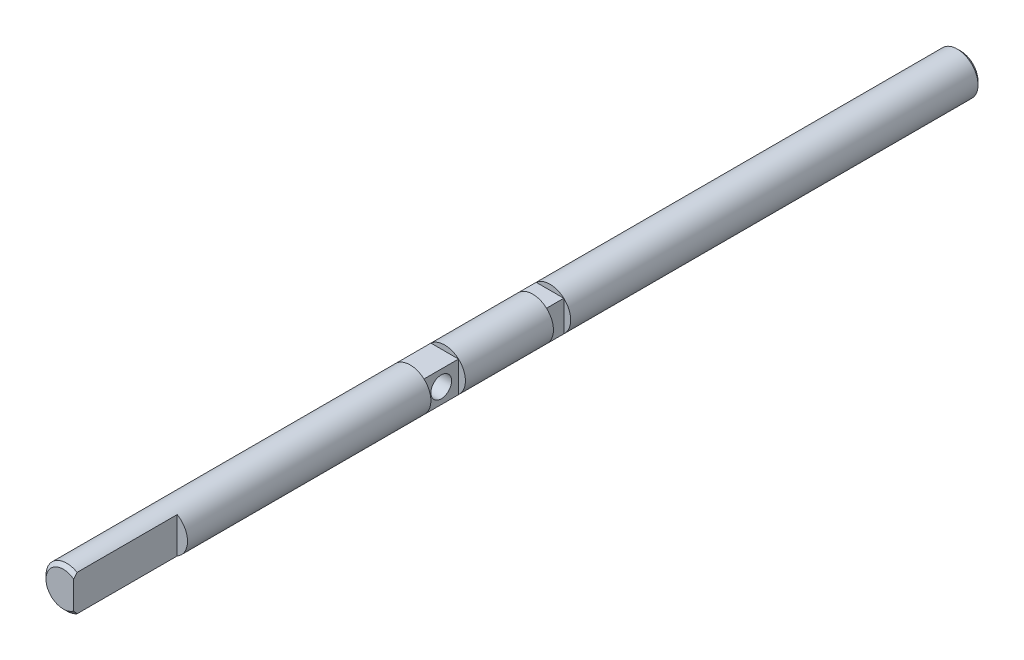
ISO-10303-21;
HEADER;
FILE_DESCRIPTION(('STEP AP214'),'2;1');
FILE_NAME('part.step','',(''),(''),'','','');
FILE_SCHEMA(('AUTOMOTIVE_DESIGN { 1 0 10303 214 1 1 1 1 }'));
ENDSEC;
DATA;
#1=APPLICATION_CONTEXT('core data for automotive mechanical design processes');
#2=APPLICATION_PROTOCOL_DEFINITION('international standard','automotive_design',2000,#1);
#3=PRODUCT_CONTEXT('',#1,'mechanical');
#4=PRODUCT('Part','Part','',(#3));
#5=PRODUCT_RELATED_PRODUCT_CATEGORY('part','',(#4));
#6=PRODUCT_DEFINITION_FORMATION('','',#4);
#7=PRODUCT_DEFINITION_CONTEXT('part definition',#1,'design');
#8=PRODUCT_DEFINITION('design','',#6,#7);
#9=PRODUCT_DEFINITION_SHAPE('','',#8);
#10=(LENGTH_UNIT() NAMED_UNIT(*) SI_UNIT(.MILLI.,.METRE.));
#11=(NAMED_UNIT(*) PLANE_ANGLE_UNIT() SI_UNIT($,.RADIAN.));
#12=(NAMED_UNIT(*) SI_UNIT($,.STERADIAN.) SOLID_ANGLE_UNIT());
#13=UNCERTAINTY_MEASURE_WITH_UNIT(LENGTH_MEASURE(1.E-05),#10,'distance_accuracy_value','');
#14=(GEOMETRIC_REPRESENTATION_CONTEXT(3) GLOBAL_UNCERTAINTY_ASSIGNED_CONTEXT((#13)) GLOBAL_UNIT_ASSIGNED_CONTEXT((#10,
#11,#12)) REPRESENTATION_CONTEXT('',''));
#15=CARTESIAN_POINT('',(0.,0.,0.));
#16=DIRECTION('',(0.,0.,1.));
#17=DIRECTION('',(1.,0.,0.));
#18=AXIS2_PLACEMENT_3D('',#15,#16,#17);
#19=CARTESIAN_POINT('',(0.,0.,260.));
#20=DIRECTION('',(0.,0.,-1.));
#21=DIRECTION('',(-1.,0.,0.));
#22=AXIS2_PLACEMENT_3D('',#19,#20,#21);
#23=CYLINDRICAL_SURFACE('',#22,6.);
#24=CARTESIAN_POINT('',(0.,0.,149.5));
#25=DIRECTION('',(0.,0.,-1.));
#26=DIRECTION('',(-1.,0.,0.));
#27=AXIS2_PLACEMENT_3D('',#24,#25,#26);
#28=CIRCLE('',#27,6.);
#29=CARTESIAN_POINT('',(-4.,-4.47213595499958,149.5));
#30=VERTEX_POINT('',#29);
#31=CARTESIAN_POINT('',(-4.,4.47213595499958,149.5));
#32=VERTEX_POINT('',#31);
#33=EDGE_CURVE('E133',#30,#32,#28,.T.);
#34=ORIENTED_EDGE('',*,*,#33,.T.);
#35=CARTESIAN_POINT('',(0.,0.,149.5));
#36=DIRECTION('',(0.,0.,-1.));
#37=DIRECTION('',(-1.,0.,0.));
#38=AXIS2_PLACEMENT_3D('',#35,#36,#37);
#39=CIRCLE('',#38,6.);
#40=CARTESIAN_POINT('',(4.,4.47213595499958,149.5));
#41=VERTEX_POINT('',#40);
#42=EDGE_CURVE('E11',#32,#41,#39,.T.);
#43=ORIENTED_EDGE('',*,*,#42,.T.);
#44=CARTESIAN_POINT('',(0.,0.,149.5));
#45=DIRECTION('',(0.,0.,-1.));
#46=DIRECTION('',(-1.,0.,0.));
#47=AXIS2_PLACEMENT_3D('',#44,#45,#46);
#48=CIRCLE('',#47,6.);
#49=CARTESIAN_POINT('',(4.,-4.47213595499958,149.5));
#50=VERTEX_POINT('',#49);
#51=EDGE_CURVE('E274',#41,#50,#48,.T.);
#52=ORIENTED_EDGE('',*,*,#51,.T.);
#53=DIRECTION('',(0.,0.,-1.));
#54=VECTOR('',#53,1.);
#55=CARTESIAN_POINT('',(4.00000000000001,-4.47213595499957,260.));
#56=LINE('',#55,#54);
#57=CARTESIAN_POINT('',(4.,-4.47213595499957,159.5));
#58=VERTEX_POINT('',#57);
#59=EDGE_CURVE('E276',#50,#58,#56,.F.);
#60=ORIENTED_EDGE('',*,*,#59,.T.);
#61=CARTESIAN_POINT('',(0.,0.,159.5));
#62=DIRECTION('',(0.,0.,1.));
#63=DIRECTION('',(1.,0.,0.));
#64=AXIS2_PLACEMENT_3D('',#61,#62,#63);
#65=CIRCLE('',#64,6.);
#66=CARTESIAN_POINT('',(4.,4.47213595499957,159.5));
#67=VERTEX_POINT('',#66);
#68=EDGE_CURVE('E280',#58,#67,#65,.T.);
#69=ORIENTED_EDGE('',*,*,#68,.T.);
#70=CARTESIAN_POINT('',(0.,0.,159.5));
#71=DIRECTION('',(0.,0.,1.));
#72=DIRECTION('',(1.,0.,0.));
#73=AXIS2_PLACEMENT_3D('',#70,#71,#72);
#74=CIRCLE('',#73,6.);
#75=CARTESIAN_POINT('',(-4.,4.47213595499957,159.5));
#76=VERTEX_POINT('',#75);
#77=EDGE_CURVE('E45',#67,#76,#74,.T.);
#78=ORIENTED_EDGE('',*,*,#77,.T.);
#79=CARTESIAN_POINT('',(0.,0.,159.5));
#80=DIRECTION('',(0.,0.,1.));
#81=DIRECTION('',(1.,0.,0.));
#82=AXIS2_PLACEMENT_3D('',#79,#80,#81);
#83=CIRCLE('',#82,6.);
#84=CARTESIAN_POINT('',(-4.,-4.47213595499958,159.5));
#85=VERTEX_POINT('',#84);
#86=EDGE_CURVE('E272',#76,#85,#83,.T.);
#87=ORIENTED_EDGE('',*,*,#86,.T.);
#88=DIRECTION('',(0.,0.,-1.));
#89=VECTOR('',#88,1.);
#90=CARTESIAN_POINT('',(-4.00000000000001,-4.47213595499957,260.));
#91=LINE('',#90,#89);
#92=EDGE_CURVE('E136',#85,#30,#91,.T.);
#93=ORIENTED_EDGE('',*,*,#92,.T.);
#94=EDGE_LOOP('',(#34,#43,#52,#60,#69,#78,#87,#93));
#95=FACE_BOUND('',#94,.T.);
#96=CARTESIAN_POINT('',(0.,0.,124.));
#97=DIRECTION('',(0.,0.,1.));
#98=DIRECTION('',(1.,0.,0.));
#99=AXIS2_PLACEMENT_3D('',#96,#97,#98);
#100=CIRCLE('',#99,6.);
#101=CARTESIAN_POINT('',(4.,-4.47213595499958,124.));
#102=VERTEX_POINT('',#101);
#103=CARTESIAN_POINT('',(4.,4.47213595499958,124.));
#104=VERTEX_POINT('',#103);
#105=EDGE_CURVE('E140',#102,#104,#100,.T.);
#106=ORIENTED_EDGE('',*,*,#105,.T.);
#107=CARTESIAN_POINT('',(0.,0.,124.));
#108=DIRECTION('',(0.,0.,1.));
#109=DIRECTION('',(1.,0.,0.));
#110=AXIS2_PLACEMENT_3D('',#107,#108,#109);
#111=CIRCLE('',#110,6.);
#112=CARTESIAN_POINT('',(-4.,4.47213595499958,124.));
#113=VERTEX_POINT('',#112);
#114=EDGE_CURVE('E287',#104,#113,#111,.T.);
#115=ORIENTED_EDGE('',*,*,#114,.T.);
#116=DIRECTION('',(0.,0.,-1.));
#117=VECTOR('',#116,1.);
#118=CARTESIAN_POINT('',(-4.00000000000002,4.47213595499956,260.));
#119=LINE('',#118,#117);
#120=CARTESIAN_POINT('',(-4.,4.47213595499958,119.));
#121=VERTEX_POINT('',#120);
#122=EDGE_CURVE('E129',#113,#121,#119,.T.);
#123=ORIENTED_EDGE('',*,*,#122,.T.);
#124=CARTESIAN_POINT('',(0.,0.,119.));
#125=DIRECTION('',(0.,0.,-1.));
#126=DIRECTION('',(-1.,0.,0.));
#127=AXIS2_PLACEMENT_3D('',#124,#125,#126);
#128=CIRCLE('',#127,6.);
#129=CARTESIAN_POINT('',(4.,4.47213595499958,119.));
#130=VERTEX_POINT('',#129);
#131=EDGE_CURVE('E285',#121,#130,#128,.T.);
#132=ORIENTED_EDGE('',*,*,#131,.T.);
#133=CARTESIAN_POINT('',(0.,0.,119.));
#134=DIRECTION('',(0.,0.,-1.));
#135=DIRECTION('',(-1.,0.,0.));
#136=AXIS2_PLACEMENT_3D('',#133,#134,#135);
#137=CIRCLE('',#136,6.);
#138=CARTESIAN_POINT('',(4.,-4.47213595499958,119.));
#139=VERTEX_POINT('',#138);
#140=EDGE_CURVE('E186',#130,#139,#137,.T.);
#141=ORIENTED_EDGE('',*,*,#140,.T.);
#142=DIRECTION('',(0.,0.,-1.));
#143=VECTOR('',#142,1.);
#144=CARTESIAN_POINT('',(4.,-4.47213595499958,260.));
#145=LINE('',#144,#143);
#146=EDGE_CURVE('E263',#139,#102,#145,.F.);
#147=ORIENTED_EDGE('',*,*,#146,.T.);
#148=EDGE_LOOP('',(#106,#115,#123,#132,#141,#147));
#149=FACE_BOUND('',#148,.T.);
#150=CARTESIAN_POINT('',(0.,0.,1.00000000000006));
#151=DIRECTION('',(0.,0.,1.));
#152=DIRECTION('',(1.,0.,0.));
#153=AXIS2_PLACEMENT_3D('',#150,#151,#152);
#154=CIRCLE('',#153,6.);
#155=CARTESIAN_POINT('',(6.,0.,1.00000000000006));
#156=VERTEX_POINT('',#155);
#157=EDGE_CURVE('E169',#156,#156,#154,.T.);
#158=ORIENTED_EDGE('',*,*,#157,.T.);
#159=EDGE_LOOP('',(#158));
#160=FACE_BOUND('',#159,.T.);
#161=CARTESIAN_POINT('',(0.,0.,259.));
#162=DIRECTION('',(0.,0.,1.));
#163=DIRECTION('',(1.,0.,0.));
#164=AXIS2_PLACEMENT_3D('',#161,#162,#163);
#165=CIRCLE('',#164,6.);
#166=CARTESIAN_POINT('',(3.,-5.19615242270663,259.));
#167=VERTEX_POINT('',#166);
#168=CARTESIAN_POINT('',(3.,5.19615242270663,259.));
#169=VERTEX_POINT('',#168);
#170=EDGE_CURVE('E166',#167,#169,#165,.F.);
#171=ORIENTED_EDGE('',*,*,#170,.T.);
#172=DIRECTION('',(0.,0.,-1.));
#173=VECTOR('',#172,1.);
#174=CARTESIAN_POINT('',(3.,5.19615242270663,260.));
#175=LINE('',#174,#173);
#176=CARTESIAN_POINT('',(3.,5.19615242270663,230.));
#177=VERTEX_POINT('',#176);
#178=EDGE_CURVE('E162',#169,#177,#175,.T.);
#179=ORIENTED_EDGE('',*,*,#178,.T.);
#180=CARTESIAN_POINT('',(0.,0.,230.));
#181=DIRECTION('',(0.,0.,-1.));
#182=DIRECTION('',(-1.,0.,0.));
#183=AXIS2_PLACEMENT_3D('',#180,#181,#182);
#184=CIRCLE('',#183,6.);
#185=CARTESIAN_POINT('',(3.,-5.19615242270663,230.));
#186=VERTEX_POINT('',#185);
#187=EDGE_CURVE('E283',#177,#186,#184,.T.);
#188=ORIENTED_EDGE('',*,*,#187,.T.);
#189=DIRECTION('',(0.,0.,-1.));
#190=VECTOR('',#189,1.);
#191=CARTESIAN_POINT('',(3.,-5.19615242270663,260.));
#192=LINE('',#191,#190);
#193=EDGE_CURVE('E159',#186,#167,#192,.F.);
#194=ORIENTED_EDGE('',*,*,#193,.T.);
#195=EDGE_LOOP('',(#171,#179,#188,#194));
#196=FACE_BOUND('',#195,.T.);
#197=ADVANCED_FACE('F35',(#95,#149,#160,#196),#23,.T.);
#198=CARTESIAN_POINT('',(0.,0.,260.));
#199=DIRECTION('',(0.,0.,1.));
#200=DIRECTION('',(1.,0.,0.));
#201=AXIS2_PLACEMENT_3D('',#198,#199,#200);
#202=PLANE('',#201);
#203=DIRECTION('',(0.,1.,0.));
#204=VECTOR('',#203,1.);
#205=CARTESIAN_POINT('',(3.,-6.,260.));
#206=LINE('',#205,#204);
#207=CARTESIAN_POINT('',(3.,-3.99999999999997,260.));
#208=VERTEX_POINT('',#207);
#209=CARTESIAN_POINT('',(3.,3.99999999999997,260.));
#210=VERTEX_POINT('',#209);
#211=EDGE_CURVE('E163',#208,#210,#206,.T.);
#212=ORIENTED_EDGE('',*,*,#211,.T.);
#213=CARTESIAN_POINT('',(0.,0.,260.));
#214=DIRECTION('',(0.,0.,1.));
#215=DIRECTION('',(1.,0.,0.));
#216=AXIS2_PLACEMENT_3D('',#213,#214,#215);
#217=CIRCLE('',#216,4.99999999999998);
#218=EDGE_CURVE('E175',#210,#208,#217,.T.);
#219=ORIENTED_EDGE('',*,*,#218,.T.);
#220=EDGE_LOOP('',(#212,#219));
#221=FACE_BOUND('',#220,.T.);
#222=ADVANCED_FACE('F231',(#221),#202,.T.);
#223=CARTESIAN_POINT('',(0.,0.,0.));
#224=DIRECTION('',(0.,0.,1.));
#225=DIRECTION('',(1.,0.,0.));
#226=AXIS2_PLACEMENT_3D('',#223,#224,#225);
#227=PLANE('',#226);
#228=CARTESIAN_POINT('',(0.,0.,0.));
#229=DIRECTION('',(0.,0.,1.));
#230=DIRECTION('',(1.,0.,0.));
#231=AXIS2_PLACEMENT_3D('',#228,#229,#230);
#232=CIRCLE('',#231,4.99999999999998);
#233=CARTESIAN_POINT('',(4.99999999999998,0.,0.));
#234=VERTEX_POINT('',#233);
#235=EDGE_CURVE('E172',#234,#234,#232,.F.);
#236=ORIENTED_EDGE('',*,*,#235,.T.);
#237=EDGE_LOOP('',(#236));
#238=FACE_BOUND('',#237,.T.);
#239=ADVANCED_FACE('F234',(#238),#227,.F.);
#240=CARTESIAN_POINT('',(0.,0.,1.00000000000006));
#241=DIRECTION('',(0.,0.,1.));
#242=DIRECTION('',(1.,0.,0.));
#243=AXIS2_PLACEMENT_3D('',#240,#241,#242);
#244=CONICAL_SURFACE('',#243,6.,0.785398163397431);
#245=ORIENTED_EDGE('',*,*,#235,.F.);
#246=EDGE_LOOP('',(#245));
#247=FACE_BOUND('',#246,.T.);
#248=ORIENTED_EDGE('',*,*,#157,.F.);
#249=EDGE_LOOP('',(#248));
#250=FACE_BOUND('',#249,.T.);
#251=ADVANCED_FACE('F238',(#247,#250),#244,.T.);
#252=CARTESIAN_POINT('',(0.,0.,260.));
#253=DIRECTION('',(0.,0.,-1.));
#254=DIRECTION('',(-1.,0.,0.));
#255=AXIS2_PLACEMENT_3D('',#252,#253,#254);
#256=CONICAL_SURFACE('',#255,4.99999999999998,0.785398163397459);
#257=CARTESIAN_POINT('',(3.,5.19696069736921,258.9993));
#258=CARTESIAN_POINT('',(3.,5.04304648800133,259.13254589526));
#259=CARTESIAN_POINT('',(3.,4.88844174768665,259.265010976117));
#260=CARTESIAN_POINT('',(3.,4.57731678489545,259.527822368717));
#261=CARTESIAN_POINT('',(3.,4.42079567751616,259.658167631543));
#262=CARTESIAN_POINT('',(3.,4.10175384544838,259.919076153864));
#263=CARTESIAN_POINT('',(3.,3.93917849562037,260.049572872212));
#264=CARTESIAN_POINT('',(3.,3.61093751630043,260.306555924297));
#265=CARTESIAN_POINT('',(3.,3.44527267397795,260.433043257994));
#266=CARTESIAN_POINT('',(3.,3.10960304077567,260.68065292239));
#267=CARTESIAN_POINT('',(3.,2.93959253274758,260.801767544421));
#268=CARTESIAN_POINT('',(3.,2.59393857026862,261.036126947878));
#269=CARTESIAN_POINT('',(3.,2.41829064631296,261.14936524762));
#270=CARTESIAN_POINT('',(3.,2.15008584437923,261.309764585436));
#271=CARTESIAN_POINT('',(3.,2.06025966519939,261.361468723446));
#272=CARTESIAN_POINT('',(3.,1.87858088715056,261.461173483124));
#273=CARTESIAN_POINT('',(3.,1.78672804620578,261.509173659257));
#274=CARTESIAN_POINT('',(3.,1.50802152418634,261.646208080929));
#275=CARTESIAN_POINT('',(3.,1.31764113263394,261.728511053573));
#276=CARTESIAN_POINT('',(3.,1.02246793669432,261.831920155782));
#277=CARTESIAN_POINT('',(3.,0.921265260491035,261.863286772009));
#278=CARTESIAN_POINT('',(3.,0.71650505078671,261.917204277123));
#279=CARTESIAN_POINT('',(3.,0.612947896371598,261.939756574683));
#280=CARTESIAN_POINT('',(3.,0.404723174667603,261.97455087258));
#281=CARTESIAN_POINT('',(3.,0.300065991033244,261.986853893458));
#282=CARTESIAN_POINT('',(3.,0.090032530986367,262.000478075201));
#283=CARTESIAN_POINT('',(3.,-0.0153436749408923,262.001800297456));
#284=CARTESIAN_POINT('',(3.,-0.225739655673933,261.993358226351));
#285=CARTESIAN_POINT('',(3.,-0.330759004503302,261.983583554109));
#286=CARTESIAN_POINT('',(3.,-0.539298274509051,261.953661324412));
#287=CARTESIAN_POINT('',(3.,-0.642817902184319,261.93351176401));
#288=CARTESIAN_POINT('',(3.,-0.848345964702959,261.883966985242));
#289=CARTESIAN_POINT('',(3.,-0.950338822599755,261.854508258451));
#290=CARTESIAN_POINT('',(3.,-1.15174775213378,261.787916105846));
#291=CARTESIAN_POINT('',(3.,-1.25116381062287,261.750782640879));
#292=CARTESIAN_POINT('',(3.,-1.4705391628215,261.660801996984));
#293=CARTESIAN_POINT('',(3.,-1.58981986384085,261.606313865013));
#294=CARTESIAN_POINT('',(3.,-1.82482176162847,261.490080017694));
#295=CARTESIAN_POINT('',(3.,-1.94054083768505,261.42833008001));
#296=CARTESIAN_POINT('',(3.,-2.16907978932093,261.299188797827));
#297=CARTESIAN_POINT('',(3.,-2.2818931162796,261.231785958271));
#298=CARTESIAN_POINT('',(3.,-2.50483243579449,261.092750439614));
#299=CARTESIAN_POINT('',(3.,-2.61495896089784,261.02111860852));
#300=CARTESIAN_POINT('',(3.,-2.83355642406012,260.874171667094));
#301=CARTESIAN_POINT('',(3.,-2.94201564201856,260.798839201293));
#302=CARTESIAN_POINT('',(3.,-3.15705813030256,260.645536865743));
#303=CARTESIAN_POINT('',(3.,-3.26364125523033,260.567566792933));
#304=CARTESIAN_POINT('',(3.,-3.58079504043759,260.330715824936));
#305=CARTESIAN_POINT('',(3.,-3.78903412828539,260.168712771221));
#306=CARTESIAN_POINT('',(3.,-4.09753950917302,259.921996882379));
#307=CARTESIAN_POINT('',(3.,-4.19948294695132,259.839350396885));
#308=CARTESIAN_POINT('',(3.,-4.40242694332984,259.67290181058));
#309=CARTESIAN_POINT('',(3.,-4.50342749005086,259.589099695242));
#310=CARTESIAN_POINT('',(3.,-4.70357112635645,259.421413366146));
#311=CARTESIAN_POINT('',(3.,-4.80272260066787,259.337539133993));
#312=CARTESIAN_POINT('',(3.,-5.00033354775502,259.168988377423));
#313=CARTESIAN_POINT('',(3.,-5.09879305273219,259.084311890776));
#314=CARTESIAN_POINT('',(3.,-5.19696069736921,258.9993));
#315=B_SPLINE_CURVE_WITH_KNOTS('',3,(#257,#258,#259,#260,#261,#262,#263,#264,#265,#266,#267,
#268,#269,#270,#271,#272,#273,#274,#275,#276,#277,#278,#279,#280,#281,#282,#283,#284,#285,#286,
#287,#288,#289,#290,#291,#292,#293,#294,#295,#296,#297,#298,#299,#300,#301,#302,#303,#304,#305,
#306,#307,#308,#309,#310,#311,#312,#313,#314),.UNSPECIFIED.,.F.,.F.,(4,2,2,2,2,2,2,2,2,2,2,2,2,
2,2,2,2,2,2,2,2,2,2,2,2,2,2,2,4),(0.,0.610748282902346,1.22179010252157,1.84715836327193,
2.47236940682347,3.09845025136063,3.72504036740972,4.03588773895742,4.3467724430329,
4.96720865796638,5.28475490038815,5.60225037292648,5.91784180108098,6.23340272420079,
6.54925903355176,6.86517634413195,7.1832971867178,7.50141965219926,7.89449486631181,
8.28779977235429,8.68192480411545,9.07597107161056,9.4720850878182,9.86822966900613,
10.6595585980658,11.0532641638827,11.446974683203,11.8365768849911,12.2261608345924),.UNSPECIFIED.);
#316=EDGE_CURVE('E185',#169,#210,#315,.T.);
#317=ORIENTED_EDGE('',*,*,#316,.F.);
#318=ORIENTED_EDGE('',*,*,#170,.F.);
#319=EDGE_CURVE('E178',#208,#167,#315,.T.);
#320=ORIENTED_EDGE('',*,*,#319,.F.);
#321=ORIENTED_EDGE('',*,*,#218,.F.);
#322=EDGE_LOOP('',(#317,#318,#320,#321));
#323=FACE_BOUND('',#322,.T.);
#324=ADVANCED_FACE('F38',(#323),#256,.T.);
#325=CARTESIAN_POINT('',(3.,-6.,230.));
#326=DIRECTION('',(0.,0.,-1.));
#327=DIRECTION('',(-1.,0.,0.));
#328=AXIS2_PLACEMENT_3D('',#325,#326,#327);
#329=PLANE('',#328);
#330=DIRECTION('',(0.,1.,0.));
#331=VECTOR('',#330,1.);
#332=CARTESIAN_POINT('',(3.,-6.,230.));
#333=LINE('',#332,#331);
#334=EDGE_CURVE('E309',#186,#177,#333,.T.);
#335=ORIENTED_EDGE('',*,*,#334,.F.);
#336=ORIENTED_EDGE('',*,*,#187,.F.);
#337=EDGE_LOOP('',(#335,#336));
#338=FACE_BOUND('',#337,.T.);
#339=ADVANCED_FACE('F194',(#338),#329,.F.);
#340=CARTESIAN_POINT('',(3.,-6.,260.));
#341=DIRECTION('',(-1.,0.,0.));
#342=DIRECTION('',(0.,0.,1.));
#343=AXIS2_PLACEMENT_3D('',#340,#341,#342);
#344=PLANE('',#343);
#345=ORIENTED_EDGE('',*,*,#316,.T.);
#346=ORIENTED_EDGE('',*,*,#211,.F.);
#347=ORIENTED_EDGE('',*,*,#319,.T.);
#348=ORIENTED_EDGE('',*,*,#193,.F.);
#349=ORIENTED_EDGE('',*,*,#334,.T.);
#350=ORIENTED_EDGE('',*,*,#178,.F.);
#351=EDGE_LOOP('',(#345,#346,#347,#348,#349,#350));
#352=FACE_BOUND('',#351,.T.);
#353=ADVANCED_FACE('F188',(#352),#344,.F.);
#354=CARTESIAN_POINT('',(6.,-6.,124.));
#355=DIRECTION('',(0.,0.,1.));
#356=DIRECTION('',(1.,0.,0.));
#357=AXIS2_PLACEMENT_3D('',#354,#355,#356);
#358=PLANE('',#357);
#359=ORIENTED_EDGE('',*,*,#105,.F.);
#360=DIRECTION('',(0.,1.,0.));
#361=VECTOR('',#360,1.);
#362=CARTESIAN_POINT('',(4.,-6.,124.));
#363=LINE('',#362,#361);
#364=EDGE_CURVE('E150',#102,#104,#363,.T.);
#365=ORIENTED_EDGE('',*,*,#364,.T.);
#366=EDGE_LOOP('',(#359,#365));
#367=FACE_BOUND('',#366,.T.);
#368=ADVANCED_FACE('F193',(#367),#358,.F.);
#369=CARTESIAN_POINT('',(4.,-6.,124.));
#370=DIRECTION('',(-1.,0.,0.));
#371=DIRECTION('',(0.,0.,1.));
#372=AXIS2_PLACEMENT_3D('',#369,#370,#371);
#373=PLANE('',#372);
#374=ORIENTED_EDGE('',*,*,#364,.F.);
#375=ORIENTED_EDGE('',*,*,#146,.F.);
#376=DIRECTION('',(0.,1.,0.));
#377=VECTOR('',#376,1.);
#378=CARTESIAN_POINT('',(4.,-6.,119.));
#379=LINE('',#378,#377);
#380=EDGE_CURVE('E58',#139,#130,#379,.T.);
#381=ORIENTED_EDGE('',*,*,#380,.T.);
#382=DIRECTION('',(0.,0.,-1.));
#383=VECTOR('',#382,1.);
#384=CARTESIAN_POINT('',(4.,4.47213595499958,260.));
#385=LINE('',#384,#383);
#386=EDGE_CURVE('E266',#104,#130,#385,.T.);
#387=ORIENTED_EDGE('',*,*,#386,.F.);
#388=EDGE_LOOP('',(#374,#375,#381,#387));
#389=FACE_BOUND('',#388,.T.);
#390=ADVANCED_FACE('F224',(#389),#373,.F.);
#391=CARTESIAN_POINT('',(4.,-6.,119.));
#392=DIRECTION('',(0.,0.,-1.));
#393=DIRECTION('',(-1.,0.,0.));
#394=AXIS2_PLACEMENT_3D('',#391,#392,#393);
#395=PLANE('',#394);
#396=ORIENTED_EDGE('',*,*,#380,.F.);
#397=ORIENTED_EDGE('',*,*,#140,.F.);
#398=EDGE_LOOP('',(#396,#397));
#399=FACE_BOUND('',#398,.T.);
#400=ADVANCED_FACE('F220',(#399),#395,.F.);
#401=CARTESIAN_POINT('',(-4.,-6.,159.5));
#402=DIRECTION('',(1.,0.,0.));
#403=DIRECTION('',(0.,0.,-1.));
#404=AXIS2_PLACEMENT_3D('',#401,#402,#403);
#405=PLANE('',#404);
#406=CARTESIAN_POINT('',(-4.,0.,154.5));
#407=DIRECTION('',(1.,0.,0.));
#408=DIRECTION('',(0.,0.,-1.));
#409=AXIS2_PLACEMENT_3D('',#406,#407,#408);
#410=CIRCLE('',#409,2.99999999999999);
#411=CARTESIAN_POINT('',(-4.,0.,151.5));
#412=VERTEX_POINT('',#411);
#413=EDGE_CURVE('E158',#412,#412,#410,.T.);
#414=ORIENTED_EDGE('',*,*,#413,.T.);
#415=EDGE_LOOP('',(#414));
#416=FACE_BOUND('',#415,.T.);
#417=DIRECTION('',(0.,1.,0.));
#418=VECTOR('',#417,1.);
#419=CARTESIAN_POINT('',(-4.,-6.,159.5));
#420=LINE('',#419,#418);
#421=EDGE_CURVE('E147',#85,#76,#420,.T.);
#422=ORIENTED_EDGE('',*,*,#421,.T.);
#423=DIRECTION('',(0.,0.,-1.));
#424=VECTOR('',#423,1.);
#425=CARTESIAN_POINT('',(-4.00000000000001,4.47213595499957,260.));
#426=LINE('',#425,#424);
#427=EDGE_CURVE('E125',#32,#76,#426,.F.);
#428=ORIENTED_EDGE('',*,*,#427,.F.);
#429=DIRECTION('',(0.,1.,0.));
#430=VECTOR('',#429,1.);
#431=CARTESIAN_POINT('',(-4.,-6.,149.5));
#432=LINE('',#431,#430);
#433=EDGE_CURVE('E145',#30,#32,#432,.T.);
#434=ORIENTED_EDGE('',*,*,#433,.F.);
#435=ORIENTED_EDGE('',*,*,#92,.F.);
#436=EDGE_LOOP('',(#422,#428,#434,#435));
#437=FACE_BOUND('',#436,.T.);
#438=ADVANCED_FACE('F144',(#416,#437),#405,.F.);
#439=CARTESIAN_POINT('',(-6.,-6.,159.5));
#440=DIRECTION('',(0.,0.,1.));
#441=DIRECTION('',(1.,0.,0.));
#442=AXIS2_PLACEMENT_3D('',#439,#440,#441);
#443=PLANE('',#442);
#444=ORIENTED_EDGE('',*,*,#421,.F.);
#445=ORIENTED_EDGE('',*,*,#86,.F.);
#446=EDGE_LOOP('',(#444,#445));
#447=FACE_BOUND('',#446,.T.);
#448=ADVANCED_FACE('F212',(#447),#443,.F.);
#449=CARTESIAN_POINT('',(-4.,-6.,149.5));
#450=DIRECTION('',(0.,0.,-1.));
#451=DIRECTION('',(-1.,0.,0.));
#452=AXIS2_PLACEMENT_3D('',#449,#450,#451);
#453=PLANE('',#452);
#454=ORIENTED_EDGE('',*,*,#33,.F.);
#455=ORIENTED_EDGE('',*,*,#433,.T.);
#456=EDGE_LOOP('',(#454,#455));
#457=FACE_BOUND('',#456,.T.);
#458=ADVANCED_FACE('F149',(#457),#453,.F.);
#459=CARTESIAN_POINT('',(4.,-6.,159.5));
#460=DIRECTION('',(0.,0.,1.));
#461=DIRECTION('',(1.,0.,0.));
#462=AXIS2_PLACEMENT_3D('',#459,#460,#461);
#463=PLANE('',#462);
#464=ORIENTED_EDGE('',*,*,#68,.F.);
#465=DIRECTION('',(0.,1.,0.));
#466=VECTOR('',#465,1.);
#467=CARTESIAN_POINT('',(4.,-6.,159.5));
#468=LINE('',#467,#466);
#469=EDGE_CURVE('E312',#58,#67,#468,.T.);
#470=ORIENTED_EDGE('',*,*,#469,.T.);
#471=EDGE_LOOP('',(#464,#470));
#472=FACE_BOUND('',#471,.T.);
#473=ADVANCED_FACE('F201',(#472),#463,.F.);
#474=CARTESIAN_POINT('',(4.,-6.,149.5));
#475=DIRECTION('',(-1.,0.,0.));
#476=DIRECTION('',(0.,0.,1.));
#477=AXIS2_PLACEMENT_3D('',#474,#475,#476);
#478=PLANE('',#477);
#479=CARTESIAN_POINT('',(4.00000000000005,0.,154.5));
#480=DIRECTION('',(1.,0.,0.));
#481=DIRECTION('',(0.,0.,-1.));
#482=AXIS2_PLACEMENT_3D('',#479,#480,#481);
#483=CIRCLE('',#482,2.99999999999999);
#484=CARTESIAN_POINT('',(4.00000000000005,0.,151.5));
#485=VERTEX_POINT('',#484);
#486=EDGE_CURVE('E303',#485,#485,#483,.T.);
#487=ORIENTED_EDGE('',*,*,#486,.F.);
#488=EDGE_LOOP('',(#487));
#489=FACE_BOUND('',#488,.T.);
#490=ORIENTED_EDGE('',*,*,#469,.F.);
#491=ORIENTED_EDGE('',*,*,#59,.F.);
#492=DIRECTION('',(0.,1.,0.));
#493=VECTOR('',#492,1.);
#494=CARTESIAN_POINT('',(4.,-6.,149.5));
#495=LINE('',#494,#493);
#496=EDGE_CURVE('E51',#50,#41,#495,.T.);
#497=ORIENTED_EDGE('',*,*,#496,.T.);
#498=DIRECTION('',(0.,0.,-1.));
#499=VECTOR('',#498,1.);
#500=CARTESIAN_POINT('',(4.00000000000001,4.47213595499957,260.));
#501=LINE('',#500,#499);
#502=EDGE_CURVE('E128',#67,#41,#501,.T.);
#503=ORIENTED_EDGE('',*,*,#502,.F.);
#504=EDGE_LOOP('',(#490,#491,#497,#503));
#505=FACE_BOUND('',#504,.T.);
#506=ADVANCED_FACE('F204',(#489,#505),#478,.F.);
#507=CARTESIAN_POINT('',(6.,-6.,149.5));
#508=DIRECTION('',(0.,0.,-1.));
#509=DIRECTION('',(-1.,0.,0.));
#510=AXIS2_PLACEMENT_3D('',#507,#508,#509);
#511=PLANE('',#510);
#512=ORIENTED_EDGE('',*,*,#496,.F.);
#513=ORIENTED_EDGE('',*,*,#51,.F.);
#514=EDGE_LOOP('',(#512,#513));
#515=FACE_BOUND('',#514,.T.);
#516=ADVANCED_FACE('F208',(#515),#511,.F.);
#517=CARTESIAN_POINT('',(-6.00000000000004,0.,154.5));
#518=DIRECTION('',(1.,0.,0.));
#519=DIRECTION('',(0.,0.,-1.));
#520=AXIS2_PLACEMENT_3D('',#517,#518,#519);
#521=CYLINDRICAL_SURFACE('',#520,2.99999999999999);
#522=ORIENTED_EDGE('',*,*,#486,.T.);
#523=EDGE_LOOP('',(#522));
#524=FACE_BOUND('',#523,.T.);
#525=ORIENTED_EDGE('',*,*,#413,.F.);
#526=EDGE_LOOP('',(#525));
#527=FACE_BOUND('',#526,.T.);
#528=ADVANCED_FACE('F196',(#524,#527),#521,.F.);
#529=CARTESIAN_POINT('',(-6.,4.47213595499958,149.5));
#530=DIRECTION('',(0.,0.,-1.));
#531=DIRECTION('',(-1.,0.,0.));
#532=AXIS2_PLACEMENT_3D('',#529,#530,#531);
#533=PLANE('',#532);
#534=DIRECTION('',(1.,0.,0.));
#535=VECTOR('',#534,1.);
#536=CARTESIAN_POINT('',(-6.,4.47213595499958,149.5));
#537=LINE('',#536,#535);
#538=EDGE_CURVE('E117',#32,#41,#537,.T.);
#539=ORIENTED_EDGE('',*,*,#538,.T.);
#540=ORIENTED_EDGE('',*,*,#42,.F.);
#541=EDGE_LOOP('',(#539,#540));
#542=FACE_BOUND('',#541,.T.);
#543=ADVANCED_FACE('F116',(#542),#533,.F.);
#544=CARTESIAN_POINT('',(-6.,6.,159.5));
#545=DIRECTION('',(0.,0.,1.));
#546=DIRECTION('',(1.,0.,0.));
#547=AXIS2_PLACEMENT_3D('',#544,#545,#546);
#548=PLANE('',#547);
#549=DIRECTION('',(1.,0.,0.));
#550=VECTOR('',#549,1.);
#551=CARTESIAN_POINT('',(-6.,4.47213595499957,159.5));
#552=LINE('',#551,#550);
#553=EDGE_CURVE('E130',#76,#67,#552,.T.);
#554=ORIENTED_EDGE('',*,*,#553,.F.);
#555=ORIENTED_EDGE('',*,*,#77,.F.);
#556=EDGE_LOOP('',(#554,#555));
#557=FACE_BOUND('',#556,.T.);
#558=ADVANCED_FACE('F292',(#557),#548,.F.);
#559=CARTESIAN_POINT('',(-6.,4.47213595499957,159.5));
#560=DIRECTION('',(0.,-1.,0.));
#561=DIRECTION('',(0.,0.,-1.));
#562=AXIS2_PLACEMENT_3D('',#559,#560,#561);
#563=PLANE('',#562);
#564=ORIENTED_EDGE('',*,*,#553,.T.);
#565=ORIENTED_EDGE('',*,*,#502,.T.);
#566=ORIENTED_EDGE('',*,*,#538,.F.);
#567=ORIENTED_EDGE('',*,*,#427,.T.);
#568=EDGE_LOOP('',(#564,#565,#566,#567));
#569=FACE_BOUND('',#568,.T.);
#570=ADVANCED_FACE('F123',(#569),#563,.F.);
#571=CARTESIAN_POINT('',(-6.,4.47213595499958,124.));
#572=DIRECTION('',(0.,0.,1.));
#573=DIRECTION('',(1.,0.,0.));
#574=AXIS2_PLACEMENT_3D('',#571,#572,#573);
#575=PLANE('',#574);
#576=DIRECTION('',(1.,0.,0.));
#577=VECTOR('',#576,1.);
#578=CARTESIAN_POINT('',(-6.,4.47213595499958,124.));
#579=LINE('',#578,#577);
#580=EDGE_CURVE('E293',#113,#104,#579,.T.);
#581=ORIENTED_EDGE('',*,*,#580,.F.);
#582=ORIENTED_EDGE('',*,*,#114,.F.);
#583=EDGE_LOOP('',(#581,#582));
#584=FACE_BOUND('',#583,.T.);
#585=ADVANCED_FACE('F332',(#584),#575,.F.);
#586=CARTESIAN_POINT('',(-6.,6.,119.));
#587=DIRECTION('',(0.,0.,-1.));
#588=DIRECTION('',(-1.,0.,0.));
#589=AXIS2_PLACEMENT_3D('',#586,#587,#588);
#590=PLANE('',#589);
#591=DIRECTION('',(1.,0.,0.));
#592=VECTOR('',#591,1.);
#593=CARTESIAN_POINT('',(-6.,4.47213595499958,119.));
#594=LINE('',#593,#592);
#595=EDGE_CURVE('E296',#121,#130,#594,.T.);
#596=ORIENTED_EDGE('',*,*,#595,.T.);
#597=ORIENTED_EDGE('',*,*,#131,.F.);
#598=EDGE_LOOP('',(#596,#597));
#599=FACE_BOUND('',#598,.T.);
#600=ADVANCED_FACE('F336',(#599),#590,.F.);
#601=CARTESIAN_POINT('',(-6.,4.47213595499958,119.));
#602=DIRECTION('',(0.,-1.,0.));
#603=DIRECTION('',(0.,0.,-1.));
#604=AXIS2_PLACEMENT_3D('',#601,#602,#603);
#605=PLANE('',#604);
#606=ORIENTED_EDGE('',*,*,#580,.T.);
#607=ORIENTED_EDGE('',*,*,#386,.T.);
#608=ORIENTED_EDGE('',*,*,#595,.F.);
#609=ORIENTED_EDGE('',*,*,#122,.F.);
#610=EDGE_LOOP('',(#606,#607,#608,#609));
#611=FACE_BOUND('',#610,.T.);
#612=ADVANCED_FACE('F339',(#611),#605,.F.);
#613=CLOSED_SHELL('',(#197,#222,#239,#251,#324,#339,#353,#368,#390,#400,#438,#448,#458,#473,
#506,#516,#528,#543,#558,#570,#585,#600,#612));
#614=MANIFOLD_SOLID_BREP('B2',#613);
#615=ADVANCED_BREP_SHAPE_REPRESENTATION('',(#18,#614),#14);
#616=SHAPE_DEFINITION_REPRESENTATION(#9,#615);
ENDSEC;
END-ISO-10303-21;
